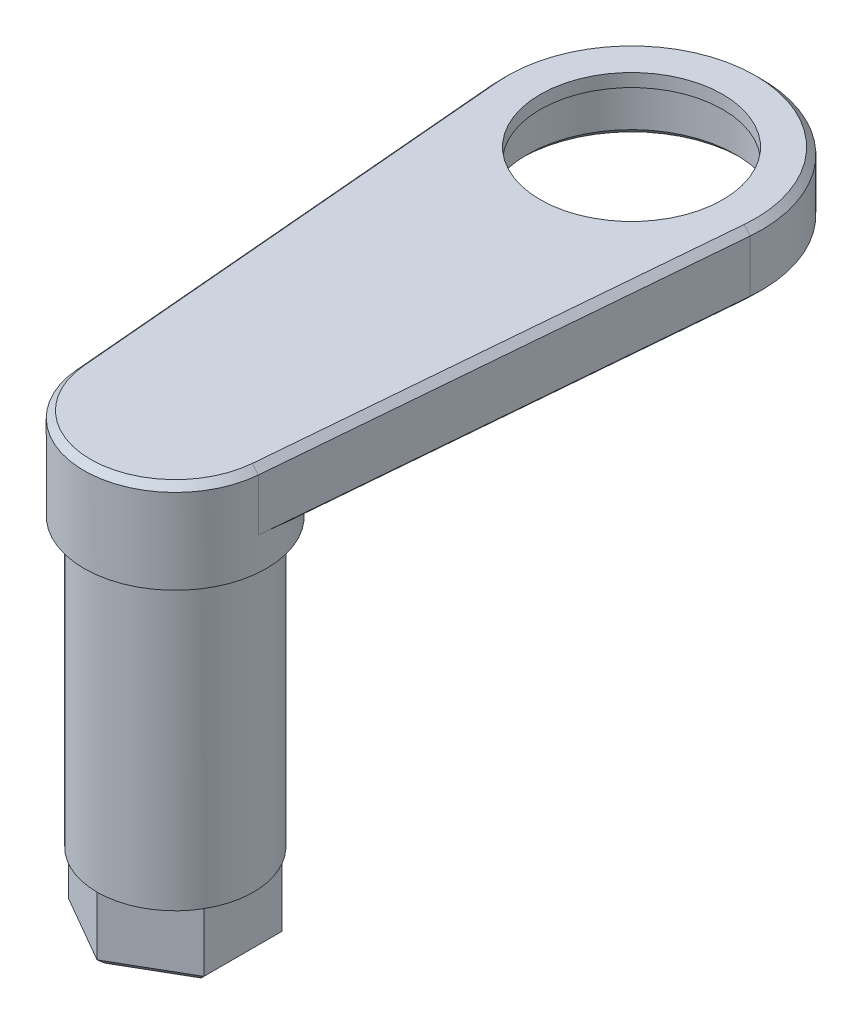
ISO-10303-21;
HEADER;
FILE_DESCRIPTION(('STEP AP214'),'2;1');
FILE_NAME('part.step','',(''),(''),'','','');
FILE_SCHEMA(('AUTOMOTIVE_DESIGN { 1 0 10303 214 1 1 1 1 }'));
ENDSEC;
DATA;
#1=APPLICATION_CONTEXT('core data for automotive mechanical design processes');
#2=APPLICATION_PROTOCOL_DEFINITION('international standard','automotive_design',2000,#1);
#3=PRODUCT_CONTEXT('',#1,'mechanical');
#4=PRODUCT('Part','Part','',(#3));
#5=PRODUCT_RELATED_PRODUCT_CATEGORY('part','',(#4));
#6=PRODUCT_DEFINITION_FORMATION('','',#4);
#7=PRODUCT_DEFINITION_CONTEXT('part definition',#1,'design');
#8=PRODUCT_DEFINITION('design','',#6,#7);
#9=PRODUCT_DEFINITION_SHAPE('','',#8);
#10=(LENGTH_UNIT() NAMED_UNIT(*) SI_UNIT(.MILLI.,.METRE.));
#11=(NAMED_UNIT(*) PLANE_ANGLE_UNIT() SI_UNIT($,.RADIAN.));
#12=(NAMED_UNIT(*) SI_UNIT($,.STERADIAN.) SOLID_ANGLE_UNIT());
#13=UNCERTAINTY_MEASURE_WITH_UNIT(LENGTH_MEASURE(1.E-05),#10,'distance_accuracy_value','');
#14=(GEOMETRIC_REPRESENTATION_CONTEXT(3) GLOBAL_UNCERTAINTY_ASSIGNED_CONTEXT((#13)) GLOBAL_UNIT_ASSIGNED_CONTEXT((#10,
#11,#12)) REPRESENTATION_CONTEXT('',''));
#15=CARTESIAN_POINT('',(0.,0.,0.));
#16=DIRECTION('',(0.,0.,1.));
#17=DIRECTION('',(1.,0.,0.));
#18=AXIS2_PLACEMENT_3D('',#15,#16,#17);
#19=CARTESIAN_POINT('',(0.,29.,-35.));
#20=DIRECTION('',(0.,-1.,0.));
#21=DIRECTION('',(1.,0.,0.));
#22=AXIS2_PLACEMENT_3D('',#19,#20,#21);
#23=CYLINDRICAL_SURFACE('',#22,8.);
#24=CARTESIAN_POINT('',(0.,24.5,-35.));
#25=DIRECTION('',(0.,1.,0.));
#26=DIRECTION('',(-1.,0.,0.));
#27=AXIS2_PLACEMENT_3D('',#24,#25,#26);
#28=CIRCLE('',#27,8.);
#29=CARTESIAN_POINT('',(-8.,24.5,-35.));
#30=VERTEX_POINT('',#29);
#31=EDGE_CURVE('E260',#30,#30,#28,.F.);
#32=ORIENTED_EDGE('',*,*,#31,.T.);
#33=EDGE_LOOP('',(#32));
#34=FACE_BOUND('',#33,.T.);
#35=CARTESIAN_POINT('',(0.,28.,-35.));
#36=DIRECTION('',(0.,1.,0.));
#37=DIRECTION('',(-1.,0.,0.));
#38=AXIS2_PLACEMENT_3D('',#35,#36,#37);
#39=CIRCLE('',#38,8.);
#40=CARTESIAN_POINT('',(-8.,28.,-35.));
#41=VERTEX_POINT('',#40);
#42=EDGE_CURVE('E347',#41,#41,#39,.T.);
#43=ORIENTED_EDGE('',*,*,#42,.T.);
#44=EDGE_LOOP('',(#43));
#45=FACE_BOUND('',#44,.T.);
#46=ADVANCED_FACE('F33',(#34,#45),#23,.F.);
#47=CARTESIAN_POINT('',(0.,0.,0.));
#48=DIRECTION('',(0.,1.,0.));
#49=DIRECTION('',(-1.,0.,0.));
#50=AXIS2_PLACEMENT_3D('',#47,#48,#49);
#51=PLANE('',#50);
#52=DIRECTION('',(-0.866025403784438,0.,0.5));
#53=VECTOR('',#52,1.);
#54=CARTESIAN_POINT('',(5.19615242270663,0.,3.));
#55=LINE('',#54,#53);
#56=CARTESIAN_POINT('',(5.19615242270663,0.,3.));
#57=VERTEX_POINT('',#56);
#58=CARTESIAN_POINT('',(0.,0.,6.));
#59=VERTEX_POINT('',#58);
#60=EDGE_CURVE('E197',#57,#59,#55,.T.);
#61=ORIENTED_EDGE('',*,*,#60,.F.);
#62=CARTESIAN_POINT('',(0.,0.,0.));
#63=DIRECTION('',(0.,1.,0.));
#64=DIRECTION('',(-1.,0.,0.));
#65=AXIS2_PLACEMENT_3D('',#62,#63,#64);
#66=CIRCLE('',#65,6.);
#67=EDGE_CURVE('E181',#59,#57,#66,.T.);
#68=ORIENTED_EDGE('',*,*,#67,.F.);
#69=EDGE_LOOP('',(#61,#68));
#70=FACE_BOUND('',#69,.T.);
#71=ADVANCED_FACE('F381',(#70),#51,.F.);
#72=DIRECTION('',(0.,0.,1.));
#73=VECTOR('',#72,1.);
#74=CARTESIAN_POINT('',(5.19615242270663,0.,-3.));
#75=LINE('',#74,#73);
#76=CARTESIAN_POINT('',(5.19615242270664,0.,-2.99999999999999));
#77=VERTEX_POINT('',#76);
#78=EDGE_CURVE('E208',#77,#57,#75,.T.);
#79=ORIENTED_EDGE('',*,*,#78,.F.);
#80=EDGE_CURVE('E701',#57,#77,#66,.T.);
#81=ORIENTED_EDGE('',*,*,#80,.F.);
#82=EDGE_LOOP('',(#79,#81));
#83=FACE_BOUND('',#82,.T.);
#84=ADVANCED_FACE('F386',(#83),#51,.F.);
#85=DIRECTION('',(0.866025403784439,0.,0.5));
#86=VECTOR('',#85,1.);
#87=CARTESIAN_POINT('',(0.,0.,-6.));
#88=LINE('',#87,#86);
#89=CARTESIAN_POINT('',(0.,0.,-6.));
#90=VERTEX_POINT('',#89);
#91=EDGE_CURVE('E205',#90,#77,#88,.T.);
#92=ORIENTED_EDGE('',*,*,#91,.F.);
#93=EDGE_CURVE('E703',#77,#90,#66,.T.);
#94=ORIENTED_EDGE('',*,*,#93,.F.);
#95=EDGE_LOOP('',(#92,#94));
#96=FACE_BOUND('',#95,.T.);
#97=ADVANCED_FACE('F636',(#96),#51,.F.);
#98=DIRECTION('',(0.866025403784438,0.,-0.5));
#99=VECTOR('',#98,1.);
#100=CARTESIAN_POINT('',(-5.19615242270663,0.,-3.));
#101=LINE('',#100,#99);
#102=CARTESIAN_POINT('',(-5.19615242270663,0.,-3.));
#103=VERTEX_POINT('',#102);
#104=EDGE_CURVE('E193',#103,#90,#101,.T.);
#105=ORIENTED_EDGE('',*,*,#104,.F.);
#106=EDGE_CURVE('E189',#90,#103,#66,.T.);
#107=ORIENTED_EDGE('',*,*,#106,.F.);
#108=EDGE_LOOP('',(#105,#107));
#109=FACE_BOUND('',#108,.T.);
#110=ADVANCED_FACE('F644',(#109),#51,.F.);
#111=DIRECTION('',(0.,0.,-1.));
#112=VECTOR('',#111,1.);
#113=CARTESIAN_POINT('',(-5.19615242270663,0.,3.));
#114=LINE('',#113,#112);
#115=CARTESIAN_POINT('',(-5.19615242270663,0.,3.));
#116=VERTEX_POINT('',#115);
#117=EDGE_CURVE('E160',#116,#103,#114,.T.);
#118=ORIENTED_EDGE('',*,*,#117,.F.);
#119=EDGE_CURVE('E183',#103,#116,#66,.T.);
#120=ORIENTED_EDGE('',*,*,#119,.F.);
#121=EDGE_LOOP('',(#118,#120));
#122=FACE_BOUND('',#121,.T.);
#123=ADVANCED_FACE('F192',(#122),#51,.F.);
#124=DIRECTION('',(-0.866025403784438,0.,-0.5));
#125=VECTOR('',#124,1.);
#126=CARTESIAN_POINT('',(0.,0.,6.));
#127=LINE('',#126,#125);
#128=EDGE_CURVE('E175',#59,#116,#127,.T.);
#129=ORIENTED_EDGE('',*,*,#128,.F.);
#130=EDGE_CURVE('E172',#116,#59,#66,.T.);
#131=ORIENTED_EDGE('',*,*,#130,.F.);
#132=EDGE_LOOP('',(#129,#131));
#133=FACE_BOUND('',#132,.T.);
#134=ADVANCED_FACE('F174',(#133),#51,.F.);
#135=CARTESIAN_POINT('',(0.,24.,0.));
#136=DIRECTION('',(0.,1.,0.));
#137=DIRECTION('',(-1.,0.,0.));
#138=AXIS2_PLACEMENT_3D('',#135,#136,#137);
#139=CYLINDRICAL_SURFACE('',#138,6.);
#140=CARTESIAN_POINT('',(0.,22.,0.));
#141=DIRECTION('',(0.,1.,0.));
#142=DIRECTION('',(-1.,0.,0.));
#143=AXIS2_PLACEMENT_3D('',#140,#141,#142);
#144=CIRCLE('',#143,6.);
#145=CARTESIAN_POINT('',(-6.,22.,0.));
#146=VERTEX_POINT('',#145);
#147=EDGE_CURVE('E191',#146,#146,#144,.T.);
#148=ORIENTED_EDGE('',*,*,#147,.F.);
#149=EDGE_LOOP('',(#148));
#150=FACE_BOUND('',#149,.T.);
#151=ORIENTED_EDGE('',*,*,#130,.T.);
#152=ORIENTED_EDGE('',*,*,#67,.T.);
#153=ORIENTED_EDGE('',*,*,#80,.T.);
#154=ORIENTED_EDGE('',*,*,#93,.T.);
#155=ORIENTED_EDGE('',*,*,#106,.T.);
#156=ORIENTED_EDGE('',*,*,#119,.T.);
#157=EDGE_LOOP('',(#151,#152,#153,#154,#155,#156));
#158=FACE_BOUND('',#157,.T.);
#159=ADVANCED_FACE('F186',(#150,#158),#139,.T.);
#160=CARTESIAN_POINT('',(6.,22.,0.));
#161=DIRECTION('',(0.,1.,0.));
#162=DIRECTION('',(-1.,0.,0.));
#163=AXIS2_PLACEMENT_3D('',#160,#161,#162);
#164=PLANE('',#163);
#165=CARTESIAN_POINT('',(0.,22.,0.));
#166=DIRECTION('',(0.,1.,0.));
#167=DIRECTION('',(-1.,0.,0.));
#168=AXIS2_PLACEMENT_3D('',#165,#166,#167);
#169=CIRCLE('',#168,7.);
#170=CARTESIAN_POINT('',(-7.,22.,0.));
#171=VERTEX_POINT('',#170);
#172=EDGE_CURVE('E222',#171,#171,#169,.T.);
#173=ORIENTED_EDGE('',*,*,#172,.F.);
#174=EDGE_LOOP('',(#173));
#175=FACE_BOUND('',#174,.T.);
#176=ORIENTED_EDGE('',*,*,#147,.T.);
#177=EDGE_LOOP('',(#176));
#178=FACE_BOUND('',#177,.T.);
#179=ADVANCED_FACE('F428',(#175,#178),#164,.F.);
#180=CARTESIAN_POINT('',(0.,24.,0.));
#181=DIRECTION('',(0.,1.,0.));
#182=DIRECTION('',(-1.,0.,0.));
#183=AXIS2_PLACEMENT_3D('',#180,#181,#182);
#184=CYLINDRICAL_SURFACE('',#183,7.);
#185=DIRECTION('',(0.,-1.,0.));
#186=VECTOR('',#185,1.);
#187=CARTESIAN_POINT('',(6.97423830966508,29.,0.6));
#188=LINE('',#187,#186);
#189=CARTESIAN_POINT('',(6.97423830966508,28.5,0.6));
#190=VERTEX_POINT('',#189);
#191=CARTESIAN_POINT('',(6.97423830966508,24.5,0.6));
#192=VERTEX_POINT('',#191);
#193=EDGE_CURVE('E199',#190,#192,#188,.T.);
#194=ORIENTED_EDGE('',*,*,#193,.F.);
#195=CARTESIAN_POINT('',(0.,28.5,0.));
#196=DIRECTION('',(0.,1.,0.));
#197=DIRECTION('',(-1.,0.,0.));
#198=AXIS2_PLACEMENT_3D('',#195,#196,#197);
#199=CIRCLE('',#198,7.);
#200=CARTESIAN_POINT('',(-6.97423830966508,28.5,0.6));
#201=VERTEX_POINT('',#200);
#202=EDGE_CURVE('E57',#190,#201,#199,.F.);
#203=ORIENTED_EDGE('',*,*,#202,.T.);
#204=DIRECTION('',(0.,-1.,0.));
#205=VECTOR('',#204,1.);
#206=CARTESIAN_POINT('',(-6.97423830966508,29.,0.6));
#207=LINE('',#206,#205);
#208=CARTESIAN_POINT('',(-6.97423830966508,24.5,0.6));
#209=VERTEX_POINT('',#208);
#210=EDGE_CURVE('E331',#201,#209,#207,.T.);
#211=ORIENTED_EDGE('',*,*,#210,.T.);
#212=CARTESIAN_POINT('',(0.,17.5000000000001,0.));
#213=DIRECTION('',(0.704504457482166,0.70710678118655,-0.0606091526731324));
#214=DIRECTION('',(-0.704504457482171,0.707106781186545,0.0606091526731328));
#215=AXIS2_PLACEMENT_3D('',#212,#213,#214);
#216=ELLIPSE('',#215,9.89949493661163,7.);
#217=CARTESIAN_POINT('',(-6.6987706770907,24.,-2.03137180637857));
#218=VERTEX_POINT('',#217);
#219=EDGE_CURVE('E11',#209,#218,#216,.F.);
#220=ORIENTED_EDGE('',*,*,#219,.T.);
#221=CARTESIAN_POINT('',(0.,24.,0.));
#222=DIRECTION('',(0.,1.,0.));
#223=DIRECTION('',(-1.,0.,0.));
#224=AXIS2_PLACEMENT_3D('',#221,#222,#223);
#225=CIRCLE('',#224,7.);
#226=CARTESIAN_POINT('',(6.6987706770907,24.,-2.03137180637857));
#227=VERTEX_POINT('',#226);
#228=EDGE_CURVE('E219',#227,#218,#225,.T.);
#229=ORIENTED_EDGE('',*,*,#228,.F.);
#230=CARTESIAN_POINT('',(0.,17.5000000000001,0.));
#231=DIRECTION('',(-0.704504457482166,0.70710678118655,-0.0606091526731324));
#232=DIRECTION('',(0.704504457482171,0.707106781186545,0.0606091526731328));
#233=AXIS2_PLACEMENT_3D('',#230,#231,#232);
#234=ELLIPSE('',#233,9.89949493661163,7.);
#235=EDGE_CURVE('E42',#227,#192,#234,.F.);
#236=ORIENTED_EDGE('',*,*,#235,.T.);
#237=EDGE_LOOP('',(#194,#203,#211,#220,#229,#236));
#238=FACE_BOUND('',#237,.T.);
#239=ORIENTED_EDGE('',*,*,#172,.T.);
#240=EDGE_LOOP('',(#239));
#241=FACE_BOUND('',#240,.T.);
#242=ADVANCED_FACE('F328',(#238,#241),#184,.T.);
#243=CARTESIAN_POINT('',(5.19615242270663,-5.,3.));
#244=DIRECTION('',(-0.5,0.,-0.866025403784438));
#245=DIRECTION('',(-0.866025403784438,0.,0.5));
#246=AXIS2_PLACEMENT_3D('',#243,#244,#245);
#247=PLANE('',#246);
#248=DIRECTION('',(0.,1.,0.));
#249=VECTOR('',#248,1.);
#250=CARTESIAN_POINT('',(0.,-5.,6.));
#251=LINE('',#250,#249);
#252=CARTESIAN_POINT('',(0.,-4.5,6.));
#253=VERTEX_POINT('',#252);
#254=EDGE_CURVE('E166',#253,#59,#251,.T.);
#255=ORIENTED_EDGE('',*,*,#254,.F.);
#256=DIRECTION('',(0.866025403784438,0.,-0.5));
#257=VECTOR('',#256,1.);
#258=CARTESIAN_POINT('',(5.19615242270663,-4.5,3.));
#259=LINE('',#258,#257);
#260=CARTESIAN_POINT('',(5.19615242270663,-4.5,3.));
#261=VERTEX_POINT('',#260);
#262=EDGE_CURVE('E249',#253,#261,#259,.T.);
#263=ORIENTED_EDGE('',*,*,#262,.T.);
#264=DIRECTION('',(0.,1.,0.));
#265=VECTOR('',#264,1.);
#266=CARTESIAN_POINT('',(5.19615242270663,-5.,3.));
#267=LINE('',#266,#265);
#268=EDGE_CURVE('E211',#261,#57,#267,.T.);
#269=ORIENTED_EDGE('',*,*,#268,.T.);
#270=ORIENTED_EDGE('',*,*,#60,.T.);
#271=EDGE_LOOP('',(#255,#263,#269,#270));
#272=FACE_BOUND('',#271,.T.);
#273=ADVANCED_FACE('F422',(#272),#247,.F.);
#274=CARTESIAN_POINT('',(0.,-5.,6.));
#275=DIRECTION('',(0.5,0.,-0.866025403784438));
#276=DIRECTION('',(-0.866025403784438,0.,-0.5));
#277=AXIS2_PLACEMENT_3D('',#274,#275,#276);
#278=PLANE('',#277);
#279=DIRECTION('',(0.,1.,0.));
#280=VECTOR('',#279,1.);
#281=CARTESIAN_POINT('',(-5.19615242270663,-5.,3.));
#282=LINE('',#281,#280);
#283=CARTESIAN_POINT('',(-5.19615242270663,-4.5,3.));
#284=VERTEX_POINT('',#283);
#285=EDGE_CURVE('E155',#284,#116,#282,.T.);
#286=ORIENTED_EDGE('',*,*,#285,.F.);
#287=DIRECTION('',(0.866025403784438,0.,0.5));
#288=VECTOR('',#287,1.);
#289=CARTESIAN_POINT('',(0.,-4.5,6.));
#290=LINE('',#289,#288);
#291=EDGE_CURVE('E247',#284,#253,#290,.T.);
#292=ORIENTED_EDGE('',*,*,#291,.T.);
#293=ORIENTED_EDGE('',*,*,#254,.T.);
#294=ORIENTED_EDGE('',*,*,#128,.T.);
#295=EDGE_LOOP('',(#286,#292,#293,#294));
#296=FACE_BOUND('',#295,.T.);
#297=ADVANCED_FACE('F195',(#296),#278,.F.);
#298=CARTESIAN_POINT('',(-5.19615242270663,-5.,3.));
#299=DIRECTION('',(1.,0.,0.));
#300=DIRECTION('',(0.,0.,-1.));
#301=AXIS2_PLACEMENT_3D('',#298,#299,#300);
#302=PLANE('',#301);
#303=DIRECTION('',(0.,1.,0.));
#304=VECTOR('',#303,1.);
#305=CARTESIAN_POINT('',(-5.19615242270663,-5.,-3.));
#306=LINE('',#305,#304);
#307=CARTESIAN_POINT('',(-5.19615242270663,-4.5,-3.));
#308=VERTEX_POINT('',#307);
#309=EDGE_CURVE('E167',#308,#103,#306,.T.);
#310=ORIENTED_EDGE('',*,*,#309,.F.);
#311=DIRECTION('',(0.,0.,1.));
#312=VECTOR('',#311,1.);
#313=CARTESIAN_POINT('',(-5.19615242270663,-4.5,3.));
#314=LINE('',#313,#312);
#315=EDGE_CURVE('E162',#308,#284,#314,.T.);
#316=ORIENTED_EDGE('',*,*,#315,.T.);
#317=ORIENTED_EDGE('',*,*,#285,.T.);
#318=ORIENTED_EDGE('',*,*,#117,.T.);
#319=EDGE_LOOP('',(#310,#316,#317,#318));
#320=FACE_BOUND('',#319,.T.);
#321=ADVANCED_FACE('F158',(#320),#302,.F.);
#322=CARTESIAN_POINT('',(-5.19615242270663,-5.,-3.));
#323=DIRECTION('',(0.5,0.,0.866025403784439));
#324=DIRECTION('',(0.866025403784439,0.,-0.5));
#325=AXIS2_PLACEMENT_3D('',#322,#323,#324);
#326=PLANE('',#325);
#327=DIRECTION('',(0.,1.,0.));
#328=VECTOR('',#327,1.);
#329=CARTESIAN_POINT('',(0.,-5.,-6.));
#330=LINE('',#329,#328);
#331=CARTESIAN_POINT('',(0.,-4.5,-6.));
#332=VERTEX_POINT('',#331);
#333=EDGE_CURVE('E215',#332,#90,#330,.T.);
#334=ORIENTED_EDGE('',*,*,#333,.F.);
#335=DIRECTION('',(-0.866025403784439,0.,0.5));
#336=VECTOR('',#335,1.);
#337=CARTESIAN_POINT('',(-5.19615242270663,-4.5,-3.));
#338=LINE('',#337,#336);
#339=EDGE_CURVE('E244',#332,#308,#338,.T.);
#340=ORIENTED_EDGE('',*,*,#339,.T.);
#341=ORIENTED_EDGE('',*,*,#309,.T.);
#342=ORIENTED_EDGE('',*,*,#104,.T.);
#343=EDGE_LOOP('',(#334,#340,#341,#342));
#344=FACE_BOUND('',#343,.T.);
#345=ADVANCED_FACE('F413',(#344),#326,.F.);
#346=CARTESIAN_POINT('',(0.,-5.,-6.));
#347=DIRECTION('',(-0.5,0.,0.866025403784438));
#348=DIRECTION('',(0.866025403784439,0.,0.5));
#349=AXIS2_PLACEMENT_3D('',#346,#347,#348);
#350=PLANE('',#349);
#351=DIRECTION('',(0.,1.,0.));
#352=VECTOR('',#351,1.);
#353=CARTESIAN_POINT('',(5.19615242270663,-5.,-3.));
#354=LINE('',#353,#352);
#355=CARTESIAN_POINT('',(5.19615242270663,-4.5,-3.));
#356=VERTEX_POINT('',#355);
#357=EDGE_CURVE('E213',#356,#77,#354,.T.);
#358=ORIENTED_EDGE('',*,*,#357,.F.);
#359=DIRECTION('',(-0.866025403784439,0.,-0.5));
#360=VECTOR('',#359,1.);
#361=CARTESIAN_POINT('',(0.,-4.5,-6.));
#362=LINE('',#361,#360);
#363=EDGE_CURVE('E242',#356,#332,#362,.T.);
#364=ORIENTED_EDGE('',*,*,#363,.T.);
#365=ORIENTED_EDGE('',*,*,#333,.T.);
#366=ORIENTED_EDGE('',*,*,#91,.T.);
#367=EDGE_LOOP('',(#358,#364,#365,#366));
#368=FACE_BOUND('',#367,.T.);
#369=ADVANCED_FACE('F409',(#368),#350,.F.);
#370=CARTESIAN_POINT('',(5.19615242270663,-5.,-3.));
#371=DIRECTION('',(-1.,0.,0.));
#372=DIRECTION('',(0.,0.,1.));
#373=AXIS2_PLACEMENT_3D('',#370,#371,#372);
#374=PLANE('',#373);
#375=ORIENTED_EDGE('',*,*,#268,.F.);
#376=DIRECTION('',(0.,0.,-1.));
#377=VECTOR('',#376,1.);
#378=CARTESIAN_POINT('',(5.19615242270663,-4.5,-3.));
#379=LINE('',#378,#377);
#380=EDGE_CURVE('E239',#261,#356,#379,.T.);
#381=ORIENTED_EDGE('',*,*,#380,.T.);
#382=ORIENTED_EDGE('',*,*,#357,.T.);
#383=ORIENTED_EDGE('',*,*,#78,.T.);
#384=EDGE_LOOP('',(#375,#381,#382,#383));
#385=FACE_BOUND('',#384,.T.);
#386=ADVANCED_FACE('F405',(#385),#374,.F.);
#387=CARTESIAN_POINT('',(0.,-5.,0.));
#388=DIRECTION('',(0.,-1.,0.));
#389=DIRECTION('',(1.,0.,0.));
#390=AXIS2_PLACEMENT_3D('',#387,#388,#389);
#391=PLANE('',#390);
#392=DIRECTION('',(0.866025403784439,0.,0.5));
#393=VECTOR('',#392,1.);
#394=CARTESIAN_POINT('',(4.94615242270663,-5.,-2.56698729810778));
#395=LINE('',#394,#393);
#396=CARTESIAN_POINT('',(0.,-5.,-5.42264973081038));
#397=VERTEX_POINT('',#396);
#398=CARTESIAN_POINT('',(4.69615242270664,-5.,-2.71132486540519));
#399=VERTEX_POINT('',#398);
#400=EDGE_CURVE('E234',#397,#399,#395,.T.);
#401=ORIENTED_EDGE('',*,*,#400,.T.);
#402=DIRECTION('',(0.,0.,1.));
#403=VECTOR('',#402,1.);
#404=CARTESIAN_POINT('',(4.69615242270663,-5.,3.));
#405=LINE('',#404,#403);
#406=CARTESIAN_POINT('',(4.69615242270663,-5.,2.71132486540519));
#407=VERTEX_POINT('',#406);
#408=EDGE_CURVE('E236',#399,#407,#405,.T.);
#409=ORIENTED_EDGE('',*,*,#408,.T.);
#410=DIRECTION('',(-0.866025403784439,0.,0.5));
#411=VECTOR('',#410,1.);
#412=CARTESIAN_POINT('',(-0.249999999999997,-5.,5.56698729810779));
#413=LINE('',#412,#411);
#414=CARTESIAN_POINT('',(0.,-5.,5.42264973081038));
#415=VERTEX_POINT('',#414);
#416=EDGE_CURVE('E180',#407,#415,#413,.T.);
#417=ORIENTED_EDGE('',*,*,#416,.T.);
#418=DIRECTION('',(-0.866025403784439,0.,-0.5));
#419=VECTOR('',#418,1.);
#420=CARTESIAN_POINT('',(-4.94615242270663,-5.,2.56698729810778));
#421=LINE('',#420,#419);
#422=CARTESIAN_POINT('',(-4.69615242270664,-5.,2.71132486540519));
#423=VERTEX_POINT('',#422);
#424=EDGE_CURVE('E228',#415,#423,#421,.T.);
#425=ORIENTED_EDGE('',*,*,#424,.T.);
#426=DIRECTION('',(0.,0.,-1.));
#427=VECTOR('',#426,1.);
#428=CARTESIAN_POINT('',(-4.69615242270663,-5.,-3.));
#429=LINE('',#428,#427);
#430=CARTESIAN_POINT('',(-4.69615242270663,-5.,-2.71132486540519));
#431=VERTEX_POINT('',#430);
#432=EDGE_CURVE('E230',#423,#431,#429,.T.);
#433=ORIENTED_EDGE('',*,*,#432,.T.);
#434=DIRECTION('',(0.866025403784439,0.,-0.5));
#435=VECTOR('',#434,1.);
#436=CARTESIAN_POINT('',(0.249999999999994,-5.,-5.56698729810778));
#437=LINE('',#436,#435);
#438=EDGE_CURVE('E232',#431,#397,#437,.T.);
#439=ORIENTED_EDGE('',*,*,#438,.T.);
#440=EDGE_LOOP('',(#401,#409,#417,#425,#433,#439));
#441=FACE_BOUND('',#440,.T.);
#442=ADVANCED_FACE('F376',(#441),#391,.T.);
#443=CARTESIAN_POINT('',(0.,24.,0.));
#444=DIRECTION('',(0.,1.,0.));
#445=DIRECTION('',(-1.,0.,0.));
#446=AXIS2_PLACEMENT_3D('',#443,#444,#445);
#447=PLANE('',#446);
#448=CARTESIAN_POINT('',(0.,24.,-35.));
#449=DIRECTION('',(0.,1.,0.));
#450=DIRECTION('',(-1.,0.,0.));
#451=AXIS2_PLACEMENT_3D('',#448,#449,#450);
#452=CIRCLE('',#451,8.49999999999999);
#453=CARTESIAN_POINT('',(-8.49999999999999,24.,-35.));
#454=VERTEX_POINT('',#453);
#455=EDGE_CURVE('E257',#454,#454,#452,.T.);
#456=ORIENTED_EDGE('',*,*,#455,.T.);
#457=EDGE_LOOP('',(#456));
#458=FACE_BOUND('',#457,.T.);
#459=CARTESIAN_POINT('',(0.,24.,-35.));
#460=DIRECTION('',(0.,1.,0.));
#461=DIRECTION('',(-1.,0.,0.));
#462=AXIS2_PLACEMENT_3D('',#459,#460,#461);
#463=CIRCLE('',#462,9.49999999999999);
#464=CARTESIAN_POINT('',(-9.46503770597402,24.,-34.1857142857143));
#465=VERTEX_POINT('',#464);
#466=CARTESIAN_POINT('',(9.46503770597402,24.,-34.1857142857143));
#467=VERTEX_POINT('',#466);
#468=EDGE_CURVE('E253',#465,#467,#463,.F.);
#469=ORIENTED_EDGE('',*,*,#468,.T.);
#470=DIRECTION('',(-0.0857142857142857,0.,0.996319758523583));
#471=VECTOR('',#470,1.);
#472=CARTESIAN_POINT('',(6.47607843040327,24.,0.557142857142856));
#473=LINE('',#472,#471);
#474=EDGE_CURVE('E255',#467,#227,#473,.T.);
#475=ORIENTED_EDGE('',*,*,#474,.T.);
#476=ORIENTED_EDGE('',*,*,#228,.T.);
#477=DIRECTION('',(-0.0857142857142857,0.,-0.996319758523583));
#478=VECTOR('',#477,1.);
#479=CARTESIAN_POINT('',(-6.47607843040327,24.,0.557142857142856));
#480=LINE('',#479,#478);
#481=EDGE_CURVE('E251',#218,#465,#480,.T.);
#482=ORIENTED_EDGE('',*,*,#481,.T.);
#483=EDGE_LOOP('',(#469,#475,#476,#482));
#484=FACE_BOUND('',#483,.T.);
#485=ADVANCED_FACE('F333',(#458,#484),#447,.F.);
#486=CARTESIAN_POINT('',(0.,29.,0.));
#487=DIRECTION('',(0.,1.,0.));
#488=DIRECTION('',(-1.,0.,0.));
#489=AXIS2_PLACEMENT_3D('',#486,#487,#488);
#490=PLANE('',#489);
#491=CARTESIAN_POINT('',(0.,29.,0.));
#492=DIRECTION('',(0.,1.,0.));
#493=DIRECTION('',(-1.,0.,0.));
#494=AXIS2_PLACEMENT_3D('',#491,#492,#493);
#495=CIRCLE('',#494,6.5);
#496=CARTESIAN_POINT('',(-6.47607843040329,29.,0.557142857142857));
#497=VERTEX_POINT('',#496);
#498=CARTESIAN_POINT('',(6.47607843040329,29.,0.557142857142857));
#499=VERTEX_POINT('',#498);
#500=EDGE_CURVE('E265',#497,#499,#495,.T.);
#501=ORIENTED_EDGE('',*,*,#500,.T.);
#502=DIRECTION('',(0.0857142857142857,0.,-0.996319758523583));
#503=VECTOR('',#502,1.);
#504=CARTESIAN_POINT('',(9.46503770597404,29.,-34.1857142857143));
#505=LINE('',#504,#503);
#506=CARTESIAN_POINT('',(9.46503770597404,29.,-34.1857142857143));
#507=VERTEX_POINT('',#506);
#508=EDGE_CURVE('E269',#499,#507,#505,.T.);
#509=ORIENTED_EDGE('',*,*,#508,.T.);
#510=CARTESIAN_POINT('',(0.,29.,-35.));
#511=DIRECTION('',(0.,1.,0.));
#512=DIRECTION('',(-1.,0.,0.));
#513=AXIS2_PLACEMENT_3D('',#510,#511,#512);
#514=CIRCLE('',#513,9.50000000000001);
#515=CARTESIAN_POINT('',(-9.46503770597404,29.,-34.1857142857143));
#516=VERTEX_POINT('',#515);
#517=EDGE_CURVE('E267',#507,#516,#514,.T.);
#518=ORIENTED_EDGE('',*,*,#517,.T.);
#519=DIRECTION('',(0.0857142857142857,0.,0.996319758523583));
#520=VECTOR('',#519,1.);
#521=CARTESIAN_POINT('',(-6.47607843040329,29.,0.557142857142857));
#522=LINE('',#521,#520);
#523=EDGE_CURVE('E263',#516,#497,#522,.T.);
#524=ORIENTED_EDGE('',*,*,#523,.T.);
#525=EDGE_LOOP('',(#501,#509,#518,#524));
#526=FACE_BOUND('',#525,.T.);
#527=CARTESIAN_POINT('',(0.,29.,-35.));
#528=DIRECTION('',(0.,1.,0.));
#529=DIRECTION('',(-1.,0.,0.));
#530=AXIS2_PLACEMENT_3D('',#527,#528,#529);
#531=CIRCLE('',#530,7.);
#532=CARTESIAN_POINT('',(-7.,29.,-35.));
#533=VERTEX_POINT('',#532);
#534=EDGE_CURVE('E304',#533,#533,#531,.T.);
#535=ORIENTED_EDGE('',*,*,#534,.F.);
#536=EDGE_LOOP('',(#535));
#537=FACE_BOUND('',#536,.T.);
#538=ADVANCED_FACE('F366',(#526,#537),#490,.T.);
#539=CARTESIAN_POINT('',(6.97423830966508,29.,0.6));
#540=DIRECTION('',(-0.996319758523583,0.,-0.0857142857142857));
#541=DIRECTION('',(-0.0857142857142857,0.,0.996319758523583));
#542=AXIS2_PLACEMENT_3D('',#539,#540,#541);
#543=PLANE('',#542);
#544=DIRECTION('',(0.,-1.,0.));
#545=VECTOR('',#544,1.);
#546=CARTESIAN_POINT('',(9.96319758523583,29.,-34.1428571428571));
#547=LINE('',#546,#545);
#548=CARTESIAN_POINT('',(9.96319758523583,28.5,-34.1428571428571));
#549=VERTEX_POINT('',#548);
#550=CARTESIAN_POINT('',(9.96319758523583,24.5,-34.1428571428571));
#551=VERTEX_POINT('',#550);
#552=EDGE_CURVE('E341',#549,#551,#547,.T.);
#553=ORIENTED_EDGE('',*,*,#552,.F.);
#554=DIRECTION('',(-0.0857142857142857,0.,0.996319758523583));
#555=VECTOR('',#554,1.);
#556=CARTESIAN_POINT('',(6.97423830966508,28.5,0.6));
#557=LINE('',#556,#555);
#558=EDGE_CURVE('E275',#549,#190,#557,.T.);
#559=ORIENTED_EDGE('',*,*,#558,.T.);
#560=ORIENTED_EDGE('',*,*,#193,.T.);
#561=DIRECTION('',(0.0857142857142857,0.,-0.996319758523583));
#562=VECTOR('',#561,1.);
#563=CARTESIAN_POINT('',(6.97423830966508,24.5,0.6));
#564=LINE('',#563,#562);
#565=EDGE_CURVE('E272',#192,#551,#564,.T.);
#566=ORIENTED_EDGE('',*,*,#565,.T.);
#567=EDGE_LOOP('',(#553,#559,#560,#566));
#568=FACE_BOUND('',#567,.T.);
#569=ADVANCED_FACE('F338',(#568),#543,.F.);
#570=CARTESIAN_POINT('',(0.,29.,-35.));
#571=DIRECTION('',(0.,-1.,0.));
#572=DIRECTION('',(1.,0.,0.));
#573=AXIS2_PLACEMENT_3D('',#570,#571,#572);
#574=CYLINDRICAL_SURFACE('',#573,10.);
#575=DIRECTION('',(0.,-1.,0.));
#576=VECTOR('',#575,1.);
#577=CARTESIAN_POINT('',(-9.96319758523583,29.,-34.1428571428571));
#578=LINE('',#577,#576);
#579=CARTESIAN_POINT('',(-9.96319758523583,28.5,-34.1428571428571));
#580=VERTEX_POINT('',#579);
#581=CARTESIAN_POINT('',(-9.96319758523583,24.5,-34.1428571428571));
#582=VERTEX_POINT('',#581);
#583=EDGE_CURVE('E342',#580,#582,#578,.T.);
#584=ORIENTED_EDGE('',*,*,#583,.F.);
#585=CARTESIAN_POINT('',(0.,28.5,-35.));
#586=DIRECTION('',(0.,1.,0.));
#587=DIRECTION('',(-1.,0.,0.));
#588=AXIS2_PLACEMENT_3D('',#585,#586,#587);
#589=CIRCLE('',#588,10.);
#590=EDGE_CURVE('E280',#580,#549,#589,.F.);
#591=ORIENTED_EDGE('',*,*,#590,.T.);
#592=ORIENTED_EDGE('',*,*,#552,.T.);
#593=CARTESIAN_POINT('',(0.,24.5,-35.));
#594=DIRECTION('',(0.,1.,0.));
#595=DIRECTION('',(-1.,0.,0.));
#596=AXIS2_PLACEMENT_3D('',#593,#594,#595);
#597=CIRCLE('',#596,10.);
#598=EDGE_CURVE('E278',#551,#582,#597,.T.);
#599=ORIENTED_EDGE('',*,*,#598,.T.);
#600=EDGE_LOOP('',(#584,#591,#592,#599));
#601=FACE_BOUND('',#600,.T.);
#602=ADVANCED_FACE('F374',(#601),#574,.T.);
#603=CARTESIAN_POINT('',(-6.97423830966508,29.,0.6));
#604=DIRECTION('',(0.996319758523583,0.,-0.0857142857142857));
#605=DIRECTION('',(-0.0857142857142857,0.,-0.996319758523583));
#606=AXIS2_PLACEMENT_3D('',#603,#604,#605);
#607=PLANE('',#606);
#608=ORIENTED_EDGE('',*,*,#210,.F.);
#609=DIRECTION('',(-0.0857142857142857,0.,-0.996319758523583));
#610=VECTOR('',#609,1.);
#611=CARTESIAN_POINT('',(-9.96319758523583,28.5,-34.1428571428571));
#612=LINE('',#611,#610);
#613=EDGE_CURVE('E284',#201,#580,#612,.T.);
#614=ORIENTED_EDGE('',*,*,#613,.T.);
#615=ORIENTED_EDGE('',*,*,#583,.T.);
#616=DIRECTION('',(0.0857142857142857,0.,0.996319758523583));
#617=VECTOR('',#616,1.);
#618=CARTESIAN_POINT('',(-6.97423830966508,24.5,0.6));
#619=LINE('',#618,#617);
#620=EDGE_CURVE('E50',#582,#209,#619,.T.);
#621=ORIENTED_EDGE('',*,*,#620,.T.);
#622=EDGE_LOOP('',(#608,#614,#615,#621));
#623=FACE_BOUND('',#622,.T.);
#624=ADVANCED_FACE('F392',(#623),#607,.F.);
#625=CARTESIAN_POINT('',(0.,28.,-35.));
#626=DIRECTION('',(0.,1.,0.));
#627=DIRECTION('',(-1.,0.,0.));
#628=AXIS2_PLACEMENT_3D('',#625,#626,#627);
#629=PLANE('',#628);
#630=CARTESIAN_POINT('',(0.,28.,-35.));
#631=DIRECTION('',(0.,1.,0.));
#632=DIRECTION('',(-1.,0.,0.));
#633=AXIS2_PLACEMENT_3D('',#630,#631,#632);
#634=CIRCLE('',#633,7.);
#635=CARTESIAN_POINT('',(-7.,28.,-35.));
#636=VERTEX_POINT('',#635);
#637=EDGE_CURVE('E350',#636,#636,#634,.T.);
#638=ORIENTED_EDGE('',*,*,#637,.T.);
#639=EDGE_LOOP('',(#638));
#640=FACE_BOUND('',#639,.T.);
#641=ORIENTED_EDGE('',*,*,#42,.F.);
#642=EDGE_LOOP('',(#641));
#643=FACE_BOUND('',#642,.T.);
#644=ADVANCED_FACE('F356',(#640,#643),#629,.F.);
#645=CARTESIAN_POINT('',(0.,28.,-35.));
#646=DIRECTION('',(0.,1.,0.));
#647=DIRECTION('',(-1.,0.,0.));
#648=AXIS2_PLACEMENT_3D('',#645,#646,#647);
#649=CYLINDRICAL_SURFACE('',#648,7.);
#650=ORIENTED_EDGE('',*,*,#637,.F.);
#651=EDGE_LOOP('',(#650));
#652=FACE_BOUND('',#651,.T.);
#653=ORIENTED_EDGE('',*,*,#534,.T.);
#654=EDGE_LOOP('',(#653));
#655=FACE_BOUND('',#654,.T.);
#656=ADVANCED_FACE('F359',(#652,#655),#649,.F.);
#657=CARTESIAN_POINT('',(-4.69615242270664,-5.,0.));
#658=DIRECTION('',(-0.707106781186551,-0.707106781186543,0.));
#659=DIRECTION('',(0.,0.,1.));
#660=AXIS2_PLACEMENT_3D('',#657,#658,#659);
#661=PLANE('',#660);
#662=DIRECTION('',(0.654653670707974,-0.654653670707981,-0.377964473009225));
#663=VECTOR('',#662,1.);
#664=CARTESIAN_POINT('',(-4.02527350517712,-5.67087891752952,2.32399274177588));
#665=LINE('',#664,#663);
#666=EDGE_CURVE('E298',#284,#423,#665,.T.);
#667=ORIENTED_EDGE('',*,*,#666,.F.);
#668=ORIENTED_EDGE('',*,*,#315,.F.);
#669=DIRECTION('',(0.654653670707974,-0.654653670707981,0.377964473009225));
#670=VECTOR('',#669,1.);
#671=CARTESIAN_POINT('',(-4.02527350517712,-5.67087891752952,-2.32399274177588));
#672=LINE('',#671,#670);
#673=EDGE_CURVE('E301',#431,#308,#672,.F.);
#674=ORIENTED_EDGE('',*,*,#673,.F.);
#675=ORIENTED_EDGE('',*,*,#432,.F.);
#676=EDGE_LOOP('',(#667,#668,#674,#675));
#677=FACE_BOUND('',#676,.T.);
#678=ADVANCED_FACE('F362',(#677),#661,.T.);
#679=CARTESIAN_POINT('',(-2.34807621135332,-5.,-4.06698729810778));
#680=DIRECTION('',(-0.353553390593276,-0.707106781186543,-0.612372435695798));
#681=DIRECTION('',(-0.866025403784439,0.,0.5));
#682=AXIS2_PLACEMENT_3D('',#679,#680,#681);
#683=PLANE('',#682);
#684=ORIENTED_EDGE('',*,*,#673,.T.);
#685=ORIENTED_EDGE('',*,*,#339,.F.);
#686=DIRECTION('',(0.,-0.654653670707981,0.755928946018451));
#687=VECTOR('',#686,1.);
#688=CARTESIAN_POINT('',(0.,-5.67087891752952,-4.64798548355176));
#689=LINE('',#688,#687);
#690=EDGE_CURVE('E295',#397,#332,#689,.F.);
#691=ORIENTED_EDGE('',*,*,#690,.F.);
#692=ORIENTED_EDGE('',*,*,#438,.F.);
#693=EDGE_LOOP('',(#684,#685,#691,#692));
#694=FACE_BOUND('',#693,.T.);
#695=ADVANCED_FACE('F451',(#694),#683,.T.);
#696=CARTESIAN_POINT('',(-2.34807621135332,-5.,4.06698729810778));
#697=DIRECTION('',(-0.353553390593276,-0.707106781186544,0.612372435695798));
#698=DIRECTION('',(0.866025403784438,0.,0.5));
#699=AXIS2_PLACEMENT_3D('',#696,#697,#698);
#700=PLANE('',#699);
#701=ORIENTED_EDGE('',*,*,#666,.T.);
#702=ORIENTED_EDGE('',*,*,#424,.F.);
#703=DIRECTION('',(0.,-0.654653670707982,-0.75592894601845));
#704=VECTOR('',#703,1.);
#705=CARTESIAN_POINT('',(0.,-5.67087891752952,4.64798548355176));
#706=LINE('',#705,#704);
#707=EDGE_CURVE('E292',#253,#415,#706,.T.);
#708=ORIENTED_EDGE('',*,*,#707,.F.);
#709=ORIENTED_EDGE('',*,*,#291,.F.);
#710=EDGE_LOOP('',(#701,#702,#708,#709));
#711=FACE_BOUND('',#710,.T.);
#712=ADVANCED_FACE('F447',(#711),#700,.T.);
#713=CARTESIAN_POINT('',(2.34807621135332,-5.,-4.06698729810778));
#714=DIRECTION('',(0.353553390593276,-0.707106781186544,-0.612372435695797));
#715=DIRECTION('',(-0.866025403784439,0.,-0.5));
#716=AXIS2_PLACEMENT_3D('',#713,#714,#715);
#717=PLANE('',#716);
#718=ORIENTED_EDGE('',*,*,#690,.T.);
#719=ORIENTED_EDGE('',*,*,#363,.F.);
#720=DIRECTION('',(-0.654653670707974,-0.654653670707981,0.377964473009226));
#721=VECTOR('',#720,1.);
#722=CARTESIAN_POINT('',(4.02527350517712,-5.67087891752952,-2.32399274177588));
#723=LINE('',#722,#721);
#724=EDGE_CURVE('E289',#399,#356,#723,.F.);
#725=ORIENTED_EDGE('',*,*,#724,.F.);
#726=ORIENTED_EDGE('',*,*,#400,.F.);
#727=EDGE_LOOP('',(#718,#719,#725,#726));
#728=FACE_BOUND('',#727,.T.);
#729=ADVANCED_FACE('F443',(#728),#717,.T.);
#730=CARTESIAN_POINT('',(2.34807621135332,-5.,4.06698729810778));
#731=DIRECTION('',(0.353553390593276,-0.707106781186543,0.612372435695799));
#732=DIRECTION('',(0.866025403784438,0.,-0.5));
#733=AXIS2_PLACEMENT_3D('',#730,#731,#732);
#734=PLANE('',#733);
#735=ORIENTED_EDGE('',*,*,#707,.T.);
#736=ORIENTED_EDGE('',*,*,#416,.F.);
#737=DIRECTION('',(0.654653670707975,0.654653670707982,0.377964473009223));
#738=VECTOR('',#737,1.);
#739=CARTESIAN_POINT('',(4.02527350517712,-5.67087891752952,2.32399274177588));
#740=LINE('',#739,#738);
#741=EDGE_CURVE('E287',#261,#407,#740,.F.);
#742=ORIENTED_EDGE('',*,*,#741,.F.);
#743=ORIENTED_EDGE('',*,*,#262,.F.);
#744=EDGE_LOOP('',(#735,#736,#742,#743));
#745=FACE_BOUND('',#744,.T.);
#746=ADVANCED_FACE('F439',(#745),#734,.T.);
#747=CARTESIAN_POINT('',(4.69615242270663,-5.,0.));
#748=DIRECTION('',(0.707106781186551,-0.707106781186544,0.));
#749=DIRECTION('',(0.,0.,-1.));
#750=AXIS2_PLACEMENT_3D('',#747,#748,#749);
#751=PLANE('',#750);
#752=ORIENTED_EDGE('',*,*,#724,.T.);
#753=ORIENTED_EDGE('',*,*,#380,.F.);
#754=ORIENTED_EDGE('',*,*,#741,.T.);
#755=ORIENTED_EDGE('',*,*,#408,.F.);
#756=EDGE_LOOP('',(#752,#753,#754,#755));
#757=FACE_BOUND('',#756,.T.);
#758=ADVANCED_FACE('F435',(#757),#751,.T.);
#759=CARTESIAN_POINT('',(0.,24.,-35.));
#760=DIRECTION('',(0.,-1.,0.));
#761=DIRECTION('',(1.,0.,0.));
#762=AXIS2_PLACEMENT_3D('',#759,#760,#761);
#763=CONICAL_SURFACE('',#762,8.49999999999999,0.785398163397441);
#764=ORIENTED_EDGE('',*,*,#31,.F.);
#765=EDGE_LOOP('',(#764));
#766=FACE_BOUND('',#765,.T.);
#767=ORIENTED_EDGE('',*,*,#455,.F.);
#768=EDGE_LOOP('',(#767));
#769=FACE_BOUND('',#768,.T.);
#770=ADVANCED_FACE('F438',(#766,#769),#763,.F.);
#771=CARTESIAN_POINT('',(-6.47607843040329,29.,0.557142857142857));
#772=DIRECTION('',(-0.704504457482171,0.707106781186545,0.0606091526731328));
#773=DIRECTION('',(-0.0857142857142857,0.,-0.996319758523583));
#774=AXIS2_PLACEMENT_3D('',#771,#772,#773);
#775=PLANE('',#774);
#776=DIRECTION('',(0.704504457482166,0.70710678118655,-0.0606091526731331));
#777=VECTOR('',#776,1.);
#778=CARTESIAN_POINT('',(-9.96319758523583,28.5,-34.1428571428571));
#779=LINE('',#778,#777);
#780=EDGE_CURVE('E309',#580,#516,#779,.T.);
#781=ORIENTED_EDGE('',*,*,#780,.F.);
#782=ORIENTED_EDGE('',*,*,#613,.F.);
#783=DIRECTION('',(-0.704504457482166,-0.70710678118655,0.0606091526731324));
#784=VECTOR('',#783,1.);
#785=CARTESIAN_POINT('',(-6.47607843040329,29.,0.557142857142857));
#786=LINE('',#785,#784);
#787=EDGE_CURVE('E290',#497,#201,#786,.T.);
#788=ORIENTED_EDGE('',*,*,#787,.F.);
#789=ORIENTED_EDGE('',*,*,#523,.F.);
#790=EDGE_LOOP('',(#781,#782,#788,#789));
#791=FACE_BOUND('',#790,.T.);
#792=ADVANCED_FACE('F461',(#791),#775,.T.);
#793=CARTESIAN_POINT('',(0.,29.,0.));
#794=DIRECTION('',(0.,-1.,0.));
#795=DIRECTION('',(1.,0.,0.));
#796=AXIS2_PLACEMENT_3D('',#793,#794,#795);
#797=CONICAL_SURFACE('',#796,6.5,0.785398163397443);
#798=ORIENTED_EDGE('',*,*,#787,.T.);
#799=ORIENTED_EDGE('',*,*,#202,.F.);
#800=DIRECTION('',(0.704504457482165,-0.707106781186551,0.0606091526731323));
#801=VECTOR('',#800,1.);
#802=CARTESIAN_POINT('',(6.47607843040329,29.,0.557142857142857));
#803=LINE('',#802,#801);
#804=EDGE_CURVE('E307',#499,#190,#803,.T.);
#805=ORIENTED_EDGE('',*,*,#804,.F.);
#806=ORIENTED_EDGE('',*,*,#500,.F.);
#807=EDGE_LOOP('',(#798,#799,#805,#806));
#808=FACE_BOUND('',#807,.T.);
#809=ADVANCED_FACE('F470',(#808),#797,.T.);
#810=CARTESIAN_POINT('',(0.,29.,-35.));
#811=DIRECTION('',(0.,-1.,0.));
#812=DIRECTION('',(1.,0.,0.));
#813=AXIS2_PLACEMENT_3D('',#810,#811,#812);
#814=CONICAL_SURFACE('',#813,9.50000000000001,0.785398163397443);
#815=ORIENTED_EDGE('',*,*,#780,.T.);
#816=ORIENTED_EDGE('',*,*,#517,.F.);
#817=DIRECTION('',(-0.704504457482165,0.707106781186551,-0.0606091526731332));
#818=VECTOR('',#817,1.);
#819=CARTESIAN_POINT('',(9.96319758523583,28.5,-34.1428571428571));
#820=LINE('',#819,#818);
#821=EDGE_CURVE('E305',#549,#507,#820,.T.);
#822=ORIENTED_EDGE('',*,*,#821,.F.);
#823=ORIENTED_EDGE('',*,*,#590,.F.);
#824=EDGE_LOOP('',(#815,#816,#822,#823));
#825=FACE_BOUND('',#824,.T.);
#826=ADVANCED_FACE('F466',(#825),#814,.T.);
#827=CARTESIAN_POINT('',(6.47607843040329,29.,0.557142857142857));
#828=DIRECTION('',(0.704504457482171,0.707106781186545,0.0606091526731328));
#829=DIRECTION('',(-0.0857142857142857,0.,0.996319758523583));
#830=AXIS2_PLACEMENT_3D('',#827,#828,#829);
#831=PLANE('',#830);
#832=ORIENTED_EDGE('',*,*,#804,.T.);
#833=ORIENTED_EDGE('',*,*,#558,.F.);
#834=ORIENTED_EDGE('',*,*,#821,.T.);
#835=ORIENTED_EDGE('',*,*,#508,.F.);
#836=EDGE_LOOP('',(#832,#833,#834,#835));
#837=FACE_BOUND('',#836,.T.);
#838=ADVANCED_FACE('F463',(#837),#831,.T.);
#839=CARTESIAN_POINT('',(-6.97423830966508,24.5,0.6));
#840=DIRECTION('',(0.704504457482166,0.70710678118655,-0.0606091526731324));
#841=DIRECTION('',(0.0857142857142857,0.,0.996319758523583));
#842=AXIS2_PLACEMENT_3D('',#839,#840,#841);
#843=PLANE('',#842);
#844=ORIENTED_EDGE('',*,*,#219,.F.);
#845=ORIENTED_EDGE('',*,*,#620,.F.);
#846=DIRECTION('',(-0.704504457482171,0.707106781186545,0.0606091526731319));
#847=VECTOR('',#846,1.);
#848=CARTESIAN_POINT('',(-9.46503770597402,24.,-34.1857142857143));
#849=LINE('',#848,#847);
#850=EDGE_CURVE('E37',#465,#582,#849,.T.);
#851=ORIENTED_EDGE('',*,*,#850,.F.);
#852=ORIENTED_EDGE('',*,*,#481,.F.);
#853=EDGE_LOOP('',(#844,#845,#851,#852));
#854=FACE_BOUND('',#853,.T.);
#855=ADVANCED_FACE('F35',(#854),#843,.F.);
#856=CARTESIAN_POINT('',(0.,24.5,-35.));
#857=DIRECTION('',(0.,1.,0.));
#858=DIRECTION('',(-1.,0.,0.));
#859=AXIS2_PLACEMENT_3D('',#856,#857,#858);
#860=CONICAL_SURFACE('',#859,10.,0.78539816339745);
#861=ORIENTED_EDGE('',*,*,#850,.T.);
#862=ORIENTED_EDGE('',*,*,#598,.F.);
#863=DIRECTION('',(0.70450445748217,0.707106781186546,0.060609152673132));
#864=VECTOR('',#863,1.);
#865=CARTESIAN_POINT('',(9.46503770597402,24.,-34.1857142857143));
#866=LINE('',#865,#864);
#867=EDGE_CURVE('E313',#467,#551,#866,.T.);
#868=ORIENTED_EDGE('',*,*,#867,.F.);
#869=ORIENTED_EDGE('',*,*,#468,.F.);
#870=EDGE_LOOP('',(#861,#862,#868,#869));
#871=FACE_BOUND('',#870,.T.);
#872=ADVANCED_FACE('F323',(#871),#860,.T.);
#873=CARTESIAN_POINT('',(6.97423830966508,24.5,0.6));
#874=DIRECTION('',(-0.704504457482166,0.70710678118655,-0.0606091526731324));
#875=DIRECTION('',(0.0857142857142857,0.,-0.996319758523583));
#876=AXIS2_PLACEMENT_3D('',#873,#874,#875);
#877=PLANE('',#876);
#878=ORIENTED_EDGE('',*,*,#235,.F.);
#879=ORIENTED_EDGE('',*,*,#474,.F.);
#880=ORIENTED_EDGE('',*,*,#867,.T.);
#881=ORIENTED_EDGE('',*,*,#565,.F.);
#882=EDGE_LOOP('',(#878,#879,#880,#881));
#883=FACE_BOUND('',#882,.T.);
#884=ADVANCED_FACE('F334',(#883),#877,.F.);
#885=CLOSED_SHELL('',(#46,#71,#84,#97,#110,#123,#134,#159,#179,#242,#273,#297,#321,#345,#369,
#386,#442,#485,#538,#569,#602,#624,#644,#656,#678,#695,#712,#729,#746,#758,#770,#792,#809,#826,
#838,#855,#872,#884));
#886=MANIFOLD_SOLID_BREP('B2',#885);
#887=ADVANCED_BREP_SHAPE_REPRESENTATION('',(#18,#886),#14);
#888=SHAPE_DEFINITION_REPRESENTATION(#9,#887);
ENDSEC;
END-ISO-10303-21;
